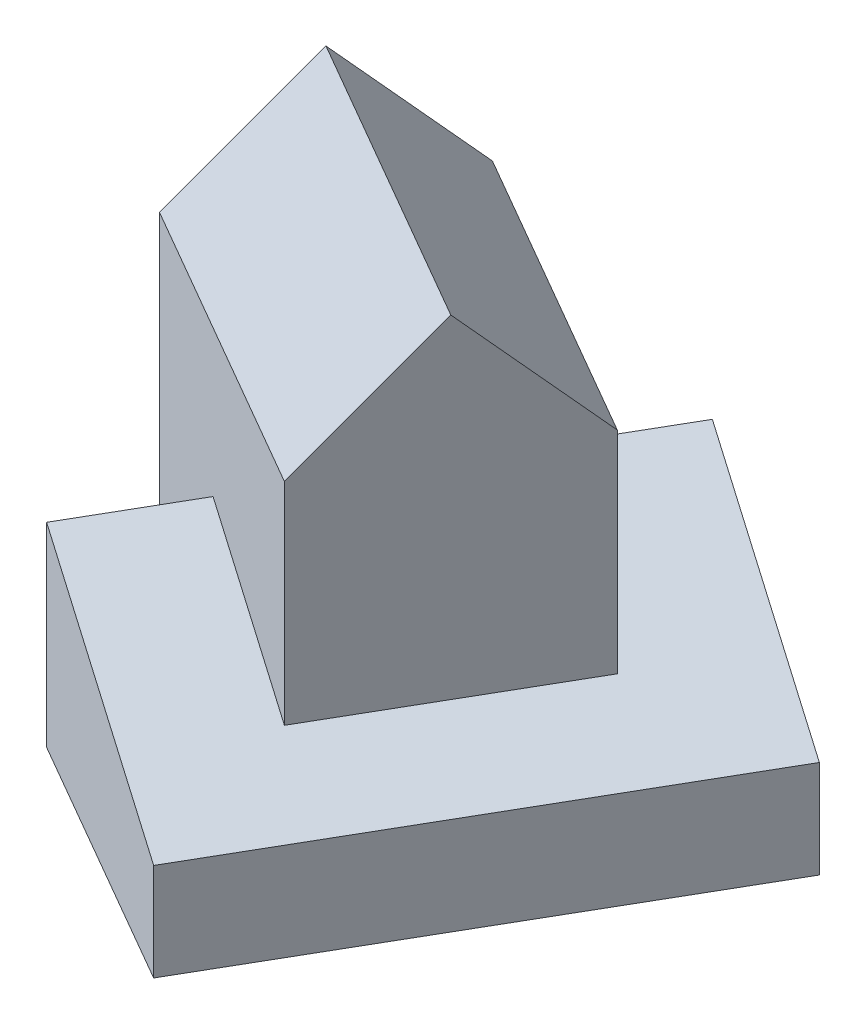
ISO-10303-21;
HEADER;
FILE_DESCRIPTION(('STEP AP214'),'2;1');
FILE_NAME('part.step','',(''),(''),'','','');
FILE_SCHEMA(('AUTOMOTIVE_DESIGN { 1 0 10303 214 1 1 1 1 }'));
ENDSEC;
DATA;
#1=APPLICATION_CONTEXT('core data for automotive mechanical design processes');
#2=APPLICATION_PROTOCOL_DEFINITION('international standard','automotive_design',2000,#1);
#3=PRODUCT_CONTEXT('',#1,'mechanical');
#4=PRODUCT('Part','Part','',(#3));
#5=PRODUCT_RELATED_PRODUCT_CATEGORY('part','',(#4));
#6=PRODUCT_DEFINITION_FORMATION('','',#4);
#7=PRODUCT_DEFINITION_CONTEXT('part definition',#1,'design');
#8=PRODUCT_DEFINITION('design','',#6,#7);
#9=PRODUCT_DEFINITION_SHAPE('','',#8);
#10=(LENGTH_UNIT() NAMED_UNIT(*) SI_UNIT(.MILLI.,.METRE.));
#11=(NAMED_UNIT(*) PLANE_ANGLE_UNIT() SI_UNIT($,.RADIAN.));
#12=(NAMED_UNIT(*) SI_UNIT($,.STERADIAN.) SOLID_ANGLE_UNIT());
#13=UNCERTAINTY_MEASURE_WITH_UNIT(LENGTH_MEASURE(1.E-05),#10,'distance_accuracy_value','');
#14=(GEOMETRIC_REPRESENTATION_CONTEXT(3) GLOBAL_UNCERTAINTY_ASSIGNED_CONTEXT((#13)) GLOBAL_UNIT_ASSIGNED_CONTEXT((#10,
#11,#12)) REPRESENTATION_CONTEXT('',''));
#15=CARTESIAN_POINT('',(0.,0.,0.));
#16=DIRECTION('',(0.,0.,1.));
#17=DIRECTION('',(1.,0.,0.));
#18=AXIS2_PLACEMENT_3D('',#15,#16,#17);
#19=CARTESIAN_POINT('',(-1.96152422706662,40.,-116.602540378444));
#20=DIRECTION('',(0.86602540378444,0.,0.499999999999998));
#21=DIRECTION('',(0.499999999999998,0.,-0.86602540378444));
#22=AXIS2_PLACEMENT_3D('',#19,#20,#21);
#23=PLANE('',#22);
#24=DIRECTION('',(0.,-1.,0.));
#25=VECTOR('',#24,1.);
#26=CARTESIAN_POINT('',(-14.4615242270665,40.,-94.951905283833));
#27=LINE('',#26,#25);
#28=CARTESIAN_POINT('',(-14.4615242270665,40.,-94.951905283833));
#29=VERTEX_POINT('',#28);
#30=CARTESIAN_POINT('',(-14.4615242270665,0.,-94.951905283833));
#31=VERTEX_POINT('',#30);
#32=EDGE_CURVE('E165',#29,#31,#27,.T.);
#33=ORIENTED_EDGE('',*,*,#32,.F.);
#34=DIRECTION('',(-0.499999999999998,0.,0.86602540378444));
#35=VECTOR('',#34,1.);
#36=CARTESIAN_POINT('',(-1.96152422706662,40.,-116.602540378444));
#37=LINE('',#36,#35);
#38=CARTESIAN_POINT('',(-1.96152422706662,40.,-116.602540378444));
#39=VERTEX_POINT('',#38);
#40=EDGE_CURVE('E186',#39,#29,#37,.T.);
#41=ORIENTED_EDGE('',*,*,#40,.F.);
#42=DIRECTION('',(0.,-1.,0.));
#43=VECTOR('',#42,1.);
#44=CARTESIAN_POINT('',(-1.96152422706662,40.,-116.602540378444));
#45=LINE('',#44,#43);
#46=CARTESIAN_POINT('',(-1.96152422706662,0.,-116.602540378444));
#47=VERTEX_POINT('',#46);
#48=EDGE_CURVE('E192',#39,#47,#45,.T.);
#49=ORIENTED_EDGE('',*,*,#48,.T.);
#50=DIRECTION('',(-0.499999999999998,0.,0.86602540378444));
#51=VECTOR('',#50,1.);
#52=CARTESIAN_POINT('',(-1.96152422706662,0.,-116.602540378444));
#53=LINE('',#52,#51);
#54=EDGE_CURVE('E53',#47,#31,#53,.T.);
#55=ORIENTED_EDGE('',*,*,#54,.T.);
#56=EDGE_LOOP('',(#33,#41,#49,#55));
#57=FACE_BOUND('',#56,.T.);
#58=ADVANCED_FACE('F30',(#57),#23,.F.);
#59=DIRECTION('',(0.,1.,0.));
#60=VECTOR('',#59,1.);
#61=CARTESIAN_POINT('',(-39.4615242270664,40.,-51.6506350946109));
#62=LINE('',#61,#60);
#63=CARTESIAN_POINT('',(-39.4615242270664,0.,-51.650635094611));
#64=VERTEX_POINT('',#63);
#65=CARTESIAN_POINT('',(-39.4615242270664,40.,-51.650635094611));
#66=VERTEX_POINT('',#65);
#67=EDGE_CURVE('E45',#64,#66,#62,.T.);
#68=ORIENTED_EDGE('',*,*,#67,.F.);
#69=CARTESIAN_POINT('',(-51.9615242270664,0.,-29.9999999999999));
#70=VERTEX_POINT('',#69);
#71=EDGE_CURVE('E183',#64,#70,#53,.T.);
#72=ORIENTED_EDGE('',*,*,#71,.T.);
#73=DIRECTION('',(0.,-1.,0.));
#74=VECTOR('',#73,1.);
#75=CARTESIAN_POINT('',(-51.9615242270664,40.,-29.9999999999999));
#76=LINE('',#75,#74);
#77=CARTESIAN_POINT('',(-51.9615242270664,40.,-29.9999999999999));
#78=VERTEX_POINT('',#77);
#79=EDGE_CURVE('E189',#78,#70,#76,.T.);
#80=ORIENTED_EDGE('',*,*,#79,.F.);
#81=EDGE_CURVE('E185',#66,#78,#37,.T.);
#82=ORIENTED_EDGE('',*,*,#81,.F.);
#83=EDGE_LOOP('',(#68,#72,#80,#82));
#84=FACE_BOUND('',#83,.T.);
#85=ADVANCED_FACE('F215',(#84),#23,.F.);
#86=CARTESIAN_POINT('',(62.9903810567662,20.,-109.102540378444));
#87=DIRECTION('',(-0.273861278752584,-0.948683298050514,-0.158113883008418));
#88=DIRECTION('',(0.960768922830523,-0.277350098112615,0.));
#89=AXIS2_PLACEMENT_3D('',#86,#87,#88);
#90=PLANE('',#89);
#91=DIRECTION('',(-0.821583836257749,0.316227766016838,-0.474341649025257));
#92=VECTOR('',#91,1.);
#93=CARTESIAN_POINT('',(37.4999999999997,20.,-64.9519052838331));
#94=LINE('',#93,#92);
#95=CARTESIAN_POINT('',(20.179491924311,26.6666666666667,-74.951905283833));
#96=VERTEX_POINT('',#95);
#97=EDGE_CURVE('E11',#96,#29,#94,.T.);
#98=ORIENTED_EDGE('',*,*,#97,.F.);
#99=DIRECTION('',(0.499999999999998,0.,-0.86602540378444));
#100=VECTOR('',#99,1.);
#101=CARTESIAN_POINT('',(45.6698729810774,26.6666666666667,-119.102540378444));
#102=LINE('',#101,#100);
#103=CARTESIAN_POINT('',(-4.82050807568885,26.6666666666667,-31.650635094611));
#104=VERTEX_POINT('',#103);
#105=EDGE_CURVE('E135',#104,#96,#102,.T.);
#106=ORIENTED_EDGE('',*,*,#105,.F.);
#107=DIRECTION('',(0.821583836257749,-0.316227766016838,0.474341649025257));
#108=VECTOR('',#107,1.);
#109=CARTESIAN_POINT('',(12.4999999999997,20.0000000000001,-21.6506350946111));
#110=LINE('',#109,#108);
#111=EDGE_CURVE('E38',#66,#104,#110,.T.);
#112=ORIENTED_EDGE('',*,*,#111,.F.);
#113=ORIENTED_EDGE('',*,*,#81,.T.);
#114=DIRECTION('',(0.821583836257751,-0.316227766016838,0.474341649025255));
#115=VECTOR('',#114,1.);
#116=CARTESIAN_POINT('',(0.,20.,0.));
#117=LINE('',#116,#115);
#118=CARTESIAN_POINT('',(0.,20.,0.));
#119=VERTEX_POINT('',#118);
#120=EDGE_CURVE('E167',#78,#119,#117,.T.);
#121=ORIENTED_EDGE('',*,*,#120,.T.);
#122=DIRECTION('',(-0.499999999999998,0.,0.86602540378444));
#123=VECTOR('',#122,1.);
#124=CARTESIAN_POINT('',(62.9903810567662,20.,-109.102540378444));
#125=LINE('',#124,#123);
#126=CARTESIAN_POINT('',(49.9999999999998,20.,-86.602540378444));
#127=VERTEX_POINT('',#126);
#128=EDGE_CURVE('E169',#127,#119,#125,.T.);
#129=ORIENTED_EDGE('',*,*,#128,.F.);
#130=DIRECTION('',(0.82158383625775,-0.316227766016838,0.474341649025255));
#131=VECTOR('',#130,1.);
#132=CARTESIAN_POINT('',(44.8038475772931,22.,-89.602540378444));
#133=LINE('',#132,#131);
#134=EDGE_CURVE('E172',#39,#127,#133,.T.);
#135=ORIENTED_EDGE('',*,*,#134,.F.);
#136=ORIENTED_EDGE('',*,*,#40,.T.);
#137=EDGE_LOOP('',(#98,#106,#112,#113,#121,#129,#135,#136));
#138=FACE_BOUND('',#137,.T.);
#139=ADVANCED_FACE('F219',(#138),#90,.F.);
#140=CARTESIAN_POINT('',(0.,40.,0.));
#141=DIRECTION('',(0.499999999999998,0.,-0.86602540378444));
#142=DIRECTION('',(-0.86602540378444,0.,-0.499999999999998));
#143=AXIS2_PLACEMENT_3D('',#140,#141,#142);
#144=PLANE('',#143);
#145=DIRECTION('',(0.,-1.,0.));
#146=VECTOR('',#145,1.);
#147=CARTESIAN_POINT('',(0.,40.,0.));
#148=LINE('',#147,#146);
#149=CARTESIAN_POINT('',(0.,0.,0.));
#150=VERTEX_POINT('',#149);
#151=EDGE_CURVE('E196',#119,#150,#148,.T.);
#152=ORIENTED_EDGE('',*,*,#151,.F.);
#153=ORIENTED_EDGE('',*,*,#120,.F.);
#154=ORIENTED_EDGE('',*,*,#79,.T.);
#155=DIRECTION('',(0.86602540378444,0.,0.499999999999998));
#156=VECTOR('',#155,1.);
#157=CARTESIAN_POINT('',(0.,0.,0.));
#158=LINE('',#157,#156);
#159=EDGE_CURVE('E175',#70,#150,#158,.T.);
#160=ORIENTED_EDGE('',*,*,#159,.T.);
#161=EDGE_LOOP('',(#152,#153,#154,#160));
#162=FACE_BOUND('',#161,.T.);
#163=ADVANCED_FACE('F32',(#162),#144,.F.);
#164=CARTESIAN_POINT('',(0.,40.,0.));
#165=DIRECTION('',(-0.86602540378444,0.,-0.499999999999998));
#166=DIRECTION('',(-0.499999999999998,0.,0.86602540378444));
#167=AXIS2_PLACEMENT_3D('',#164,#165,#166);
#168=PLANE('',#167);
#169=DIRECTION('',(0.,-1.,0.));
#170=VECTOR('',#169,1.);
#171=CARTESIAN_POINT('',(49.9999999999998,40.,-86.602540378444));
#172=LINE('',#171,#170);
#173=CARTESIAN_POINT('',(49.9999999999998,0.,-86.602540378444));
#174=VERTEX_POINT('',#173);
#175=EDGE_CURVE('E194',#127,#174,#172,.T.);
#176=ORIENTED_EDGE('',*,*,#175,.F.);
#177=ORIENTED_EDGE('',*,*,#128,.T.);
#178=ORIENTED_EDGE('',*,*,#151,.T.);
#179=DIRECTION('',(0.499999999999998,0.,-0.86602540378444));
#180=VECTOR('',#179,1.);
#181=CARTESIAN_POINT('',(0.,0.,0.));
#182=LINE('',#181,#180);
#183=EDGE_CURVE('E178',#150,#174,#182,.T.);
#184=ORIENTED_EDGE('',*,*,#183,.T.);
#185=EDGE_LOOP('',(#176,#177,#178,#184));
#186=FACE_BOUND('',#185,.T.);
#187=ADVANCED_FACE('F222',(#186),#168,.F.);
#188=CARTESIAN_POINT('',(49.9999999999998,40.,-86.602540378444));
#189=DIRECTION('',(-0.499999999999998,0.,0.86602540378444));
#190=DIRECTION('',(0.86602540378444,0.,0.499999999999998));
#191=AXIS2_PLACEMENT_3D('',#188,#189,#190);
#192=PLANE('',#191);
#193=ORIENTED_EDGE('',*,*,#48,.F.);
#194=ORIENTED_EDGE('',*,*,#134,.T.);
#195=ORIENTED_EDGE('',*,*,#175,.T.);
#196=DIRECTION('',(-0.86602540378444,0.,-0.499999999999998));
#197=VECTOR('',#196,1.);
#198=CARTESIAN_POINT('',(49.9999999999998,0.,-86.602540378444));
#199=LINE('',#198,#197);
#200=EDGE_CURVE('E181',#174,#47,#199,.T.);
#201=ORIENTED_EDGE('',*,*,#200,.T.);
#202=EDGE_LOOP('',(#193,#194,#195,#201));
#203=FACE_BOUND('',#202,.T.);
#204=ADVANCED_FACE('F226',(#203),#192,.F.);
#205=CARTESIAN_POINT('',(-51.9615242270664,0.,-29.9999999999998));
#206=DIRECTION('',(0.,1.,0.));
#207=DIRECTION('',(0.,0.,1.));
#208=AXIS2_PLACEMENT_3D('',#205,#206,#207);
#209=PLANE('',#208);
#210=ORIENTED_EDGE('',*,*,#71,.F.);
#211=DIRECTION('',(0.866025403784439,0.,0.5));
#212=VECTOR('',#211,1.);
#213=CARTESIAN_POINT('',(-4.82050807568885,0.,-31.650635094611));
#214=LINE('',#213,#212);
#215=CARTESIAN_POINT('',(-65.4422863405996,0.,-66.650635094611));
#216=VERTEX_POINT('',#215);
#217=EDGE_CURVE('E126',#216,#64,#214,.T.);
#218=ORIENTED_EDGE('',*,*,#217,.F.);
#219=DIRECTION('',(-0.499999999999998,0.,0.86602540378444));
#220=VECTOR('',#219,1.);
#221=CARTESIAN_POINT('',(-65.4422863405996,0.,-66.650635094611));
#222=LINE('',#221,#220);
#223=CARTESIAN_POINT('',(-40.4422863405997,0.,-109.951905283833));
#224=VERTEX_POINT('',#223);
#225=EDGE_CURVE('E153',#224,#216,#222,.T.);
#226=ORIENTED_EDGE('',*,*,#225,.F.);
#227=DIRECTION('',(-0.866025403784439,0.,-0.5));
#228=VECTOR('',#227,1.);
#229=CARTESIAN_POINT('',(20.179491924311,0.,-74.951905283833));
#230=LINE('',#229,#228);
#231=EDGE_CURVE('E151',#31,#224,#230,.T.);
#232=ORIENTED_EDGE('',*,*,#231,.F.);
#233=ORIENTED_EDGE('',*,*,#54,.F.);
#234=ORIENTED_EDGE('',*,*,#200,.F.);
#235=ORIENTED_EDGE('',*,*,#183,.F.);
#236=ORIENTED_EDGE('',*,*,#159,.F.);
#237=EDGE_LOOP('',(#210,#218,#226,#232,#233,#234,#235,#236));
#238=FACE_BOUND('',#237,.T.);
#239=ADVANCED_FACE('F210',(#238),#209,.F.);
#240=CARTESIAN_POINT('',(20.179491924311,70.,-74.951905283833));
#241=DIRECTION('',(-0.5,0.,0.866025403784439));
#242=DIRECTION('',(0.866025403784439,0.,0.5));
#243=AXIS2_PLACEMENT_3D('',#240,#241,#242);
#244=PLANE('',#243);
#245=ORIENTED_EDGE('',*,*,#97,.T.);
#246=ORIENTED_EDGE('',*,*,#32,.T.);
#247=ORIENTED_EDGE('',*,*,#231,.T.);
#248=DIRECTION('',(0.,-1.,0.));
#249=VECTOR('',#248,1.);
#250=CARTESIAN_POINT('',(-40.4422863405997,70.,-109.951905283833));
#251=LINE('',#250,#249);
#252=CARTESIAN_POINT('',(-40.4422863405997,70.,-109.951905283833));
#253=VERTEX_POINT('',#252);
#254=EDGE_CURVE('E120',#253,#224,#251,.T.);
#255=ORIENTED_EDGE('',*,*,#254,.F.);
#256=DIRECTION('',(-0.866025403784439,0.,-0.5));
#257=VECTOR('',#256,1.);
#258=CARTESIAN_POINT('',(20.179491924311,70.,-74.951905283833));
#259=LINE('',#258,#257);
#260=CARTESIAN_POINT('',(20.179491924311,70.,-74.951905283833));
#261=VERTEX_POINT('',#260);
#262=EDGE_CURVE('E115',#261,#253,#259,.T.);
#263=ORIENTED_EDGE('',*,*,#262,.F.);
#264=DIRECTION('',(0.,-1.,0.));
#265=VECTOR('',#264,1.);
#266=CARTESIAN_POINT('',(20.179491924311,70.,-74.951905283833));
#267=LINE('',#266,#265);
#268=EDGE_CURVE('E118',#261,#96,#267,.T.);
#269=ORIENTED_EDGE('',*,*,#268,.T.);
#270=EDGE_LOOP('',(#245,#246,#247,#255,#263,#269));
#271=FACE_BOUND('',#270,.T.);
#272=ADVANCED_FACE('F117',(#271),#244,.F.);
#273=CARTESIAN_POINT('',(-4.82050807568885,70.,-31.650635094611));
#274=DIRECTION('',(0.5,0.,-0.866025403784439));
#275=DIRECTION('',(-0.866025403784439,0.,-0.5));
#276=AXIS2_PLACEMENT_3D('',#273,#274,#275);
#277=PLANE('',#276);
#278=ORIENTED_EDGE('',*,*,#217,.T.);
#279=ORIENTED_EDGE('',*,*,#67,.T.);
#280=ORIENTED_EDGE('',*,*,#111,.T.);
#281=DIRECTION('',(0.,-1.,0.));
#282=VECTOR('',#281,1.);
#283=CARTESIAN_POINT('',(-4.82050807568885,70.,-31.650635094611));
#284=LINE('',#283,#282);
#285=CARTESIAN_POINT('',(-4.82050807568885,70.,-31.650635094611));
#286=VERTEX_POINT('',#285);
#287=EDGE_CURVE('E136',#286,#104,#284,.T.);
#288=ORIENTED_EDGE('',*,*,#287,.F.);
#289=DIRECTION('',(0.866025403784439,0.,0.5));
#290=VECTOR('',#289,1.);
#291=CARTESIAN_POINT('',(-4.82050807568885,70.,-31.650635094611));
#292=LINE('',#291,#290);
#293=CARTESIAN_POINT('',(-65.4422863405996,70.,-66.650635094611));
#294=VERTEX_POINT('',#293);
#295=EDGE_CURVE('E125',#294,#286,#292,.T.);
#296=ORIENTED_EDGE('',*,*,#295,.F.);
#297=DIRECTION('',(0.,-1.,0.));
#298=VECTOR('',#297,1.);
#299=CARTESIAN_POINT('',(-65.4422863405996,70.,-66.650635094611));
#300=LINE('',#299,#298);
#301=EDGE_CURVE('E160',#294,#216,#300,.T.);
#302=ORIENTED_EDGE('',*,*,#301,.T.);
#303=EDGE_LOOP('',(#278,#279,#280,#288,#296,#302));
#304=FACE_BOUND('',#303,.T.);
#305=ADVANCED_FACE('F200',(#304),#277,.F.);
#306=CARTESIAN_POINT('',(-4.82050807568885,70.,-31.650635094611));
#307=DIRECTION('',(-0.86602540378444,0.,-0.499999999999998));
#308=DIRECTION('',(-0.499999999999998,0.,0.86602540378444));
#309=AXIS2_PLACEMENT_3D('',#306,#307,#308);
#310=PLANE('',#309);
#311=ORIENTED_EDGE('',*,*,#287,.T.);
#312=ORIENTED_EDGE('',*,*,#105,.T.);
#313=ORIENTED_EDGE('',*,*,#268,.F.);
#314=DIRECTION('',(-0.353553390593272,0.707106781186547,0.612372435695796));
#315=VECTOR('',#314,1.);
#316=CARTESIAN_POINT('',(7.67949192431109,95.,-53.301270189222));
#317=LINE('',#316,#315);
#318=CARTESIAN_POINT('',(7.67949192431109,95.,-53.301270189222));
#319=VERTEX_POINT('',#318);
#320=EDGE_CURVE('E134',#261,#319,#317,.T.);
#321=ORIENTED_EDGE('',*,*,#320,.T.);
#322=DIRECTION('',(-0.353553390593272,-0.707106781186547,0.612372435695796));
#323=VECTOR('',#322,1.);
#324=CARTESIAN_POINT('',(-4.82050807568886,70.,-31.650635094611));
#325=LINE('',#324,#323);
#326=EDGE_CURVE('E142',#319,#286,#325,.T.);
#327=ORIENTED_EDGE('',*,*,#326,.T.);
#328=EDGE_LOOP('',(#311,#312,#313,#321,#327));
#329=FACE_BOUND('',#328,.T.);
#330=ADVANCED_FACE('F132',(#329),#310,.F.);
#331=CARTESIAN_POINT('',(-65.4422863405996,70.,-66.650635094611));
#332=DIRECTION('',(0.86602540378444,0.,0.499999999999998));
#333=DIRECTION('',(0.499999999999998,0.,-0.86602540378444));
#334=AXIS2_PLACEMENT_3D('',#331,#332,#333);
#335=PLANE('',#334);
#336=ORIENTED_EDGE('',*,*,#225,.T.);
#337=ORIENTED_EDGE('',*,*,#301,.F.);
#338=DIRECTION('',(-0.353553390593272,-0.707106781186547,0.612372435695796));
#339=VECTOR('',#338,1.);
#340=CARTESIAN_POINT('',(-65.4422863405997,70.,-66.6506350946108));
#341=LINE('',#340,#339);
#342=CARTESIAN_POINT('',(-52.9422863405997,95.,-88.3012701892218));
#343=VERTEX_POINT('',#342);
#344=EDGE_CURVE('E141',#343,#294,#341,.T.);
#345=ORIENTED_EDGE('',*,*,#344,.F.);
#346=DIRECTION('',(-0.353553390593272,0.707106781186547,0.612372435695796));
#347=VECTOR('',#346,1.);
#348=CARTESIAN_POINT('',(-52.9422863405997,95.,-88.3012701892218));
#349=LINE('',#348,#347);
#350=EDGE_CURVE('E145',#253,#343,#349,.T.);
#351=ORIENTED_EDGE('',*,*,#350,.F.);
#352=ORIENTED_EDGE('',*,*,#254,.T.);
#353=EDGE_LOOP('',(#336,#337,#345,#351,#352));
#354=FACE_BOUND('',#353,.T.);
#355=ADVANCED_FACE('F249',(#354),#335,.F.);
#356=CARTESIAN_POINT('',(-65.4422863405997,70.,-66.6506350946108));
#357=DIRECTION('',(-0.353553390593272,0.707106781186548,0.612372435695795));
#358=DIRECTION('',(0.,-0.654653670707978,0.755928946018454));
#359=AXIS2_PLACEMENT_3D('',#356,#357,#358);
#360=PLANE('',#359);
#361=ORIENTED_EDGE('',*,*,#326,.F.);
#362=DIRECTION('',(0.86602540378444,0.,0.499999999999998));
#363=VECTOR('',#362,1.);
#364=CARTESIAN_POINT('',(-52.9422863405997,95.,-88.3012701892218));
#365=LINE('',#364,#363);
#366=EDGE_CURVE('E139',#343,#319,#365,.T.);
#367=ORIENTED_EDGE('',*,*,#366,.F.);
#368=ORIENTED_EDGE('',*,*,#344,.T.);
#369=ORIENTED_EDGE('',*,*,#295,.T.);
#370=EDGE_LOOP('',(#361,#367,#368,#369));
#371=FACE_BOUND('',#370,.T.);
#372=ADVANCED_FACE('F204',(#371),#360,.T.);
#373=CARTESIAN_POINT('',(-52.9422863405997,95.,-88.3012701892218));
#374=DIRECTION('',(0.353553390593272,0.707106781186548,-0.612372435695795));
#375=DIRECTION('',(0.,0.654653670707977,0.755928946018454));
#376=AXIS2_PLACEMENT_3D('',#373,#374,#375);
#377=PLANE('',#376);
#378=ORIENTED_EDGE('',*,*,#320,.F.);
#379=ORIENTED_EDGE('',*,*,#262,.T.);
#380=ORIENTED_EDGE('',*,*,#350,.T.);
#381=ORIENTED_EDGE('',*,*,#366,.T.);
#382=EDGE_LOOP('',(#378,#379,#380,#381));
#383=FACE_BOUND('',#382,.T.);
#384=ADVANCED_FACE('F138',(#383),#377,.T.);
#385=CLOSED_SHELL('',(#58,#85,#139,#163,#187,#204,#239,#272,#305,#330,#355,#372,#384));
#386=MANIFOLD_SOLID_BREP('B2',#385);
#387=ADVANCED_BREP_SHAPE_REPRESENTATION('',(#18,#386),#14);
#388=SHAPE_DEFINITION_REPRESENTATION(#9,#387);
ENDSEC;
END-ISO-10303-21;
